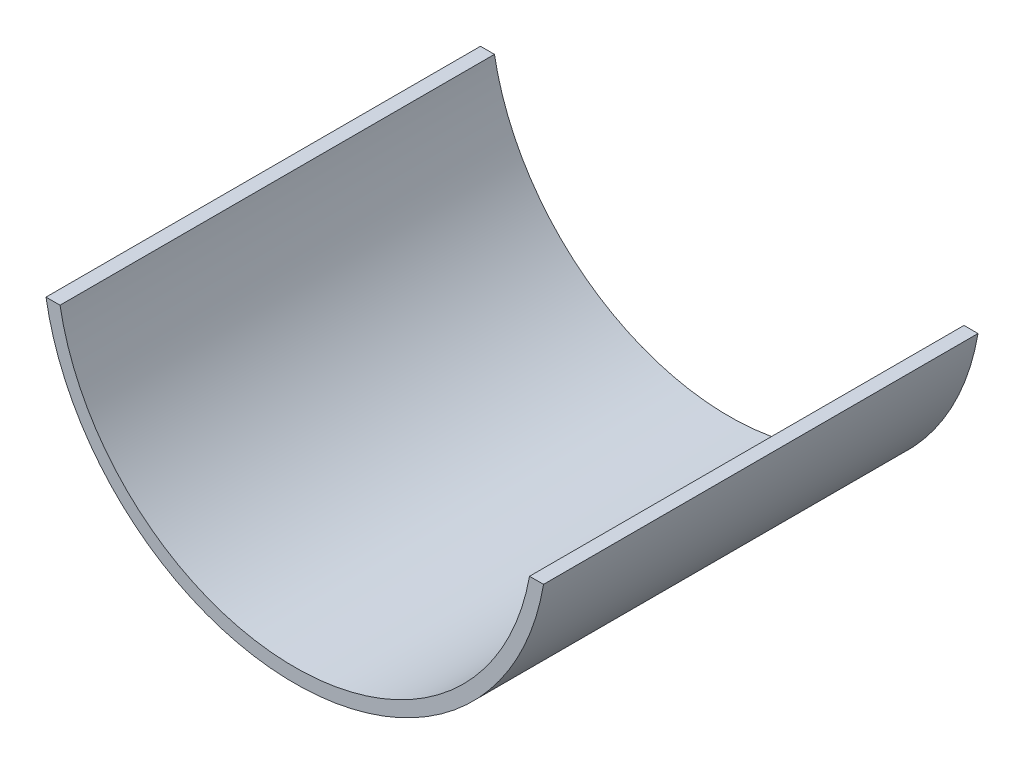
ISO-10303-21;
HEADER;
FILE_DESCRIPTION(('STEP AP214'),'2;1');
FILE_NAME('part.step','',(''),(''),'','','');
FILE_SCHEMA(('AUTOMOTIVE_DESIGN { 1 0 10303 214 1 1 1 1 }'));
ENDSEC;
DATA;
#1=APPLICATION_CONTEXT('core data for automotive mechanical design processes');
#2=APPLICATION_PROTOCOL_DEFINITION('international standard','automotive_design',2000,#1);
#3=PRODUCT_CONTEXT('',#1,'mechanical');
#4=PRODUCT('Part','Part','',(#3));
#5=PRODUCT_RELATED_PRODUCT_CATEGORY('part','',(#4));
#6=PRODUCT_DEFINITION_FORMATION('','',#4);
#7=PRODUCT_DEFINITION_CONTEXT('part definition',#1,'design');
#8=PRODUCT_DEFINITION('design','',#6,#7);
#9=PRODUCT_DEFINITION_SHAPE('','',#8);
#10=(LENGTH_UNIT() NAMED_UNIT(*) SI_UNIT(.MILLI.,.METRE.));
#11=(NAMED_UNIT(*) PLANE_ANGLE_UNIT() SI_UNIT($,.RADIAN.));
#12=(NAMED_UNIT(*) SI_UNIT($,.STERADIAN.) SOLID_ANGLE_UNIT());
#13=UNCERTAINTY_MEASURE_WITH_UNIT(LENGTH_MEASURE(1.E-05),#10,'distance_accuracy_value','');
#14=(GEOMETRIC_REPRESENTATION_CONTEXT(3) GLOBAL_UNCERTAINTY_ASSIGNED_CONTEXT((#13)) GLOBAL_UNIT_ASSIGNED_CONTEXT((#10,
#11,#12)) REPRESENTATION_CONTEXT('',''));
#15=CARTESIAN_POINT('',(0.,0.,0.));
#16=DIRECTION('',(0.,0.,1.));
#17=DIRECTION('',(1.,0.,0.));
#18=AXIS2_PLACEMENT_3D('',#15,#16,#17);
#19=CARTESIAN_POINT('',(0.,0.880200892857,0.));
#20=DIRECTION('',(0.,0.,-1.));
#21=DIRECTION('',(-1.,0.,0.));
#22=AXIS2_PLACEMENT_3D('',#19,#20,#21);
#23=CYLINDRICAL_SURFACE('',#22,0.170200892857);
#24=CARTESIAN_POINT('',(0.,0.880200892857,0.));
#25=DIRECTION('',(0.,0.,-1.));
#26=DIRECTION('',(-1.,0.,0.));
#27=AXIS2_PLACEMENT_3D('',#24,#25,#26);
#28=CIRCLE('',#27,0.170200892857);
#29=CARTESIAN_POINT('',(-0.16749999999994,0.85,0.));
#30=VERTEX_POINT('',#29);
#31=CARTESIAN_POINT('',(0.16749999999994,0.85,0.));
#32=VERTEX_POINT('',#31);
#33=EDGE_CURVE('E59',#30,#32,#28,.F.);
#34=ORIENTED_EDGE('',*,*,#33,.F.);
#35=DIRECTION('',(0.,0.,1.));
#36=VECTOR('',#35,1.);
#37=CARTESIAN_POINT('',(-0.1675,0.85,0.));
#38=LINE('',#37,#36);
#39=CARTESIAN_POINT('',(-0.16749999999994,0.85,0.310000002384));
#40=VERTEX_POINT('',#39);
#41=EDGE_CURVE('E55',#40,#30,#38,.F.);
#42=ORIENTED_EDGE('',*,*,#41,.F.);
#43=CARTESIAN_POINT('',(0.,0.880200892857,0.310000002384));
#44=DIRECTION('',(0.,0.,-1.));
#45=DIRECTION('',(-1.,0.,0.));
#46=AXIS2_PLACEMENT_3D('',#43,#44,#45);
#47=CIRCLE('',#46,0.170200892857);
#48=CARTESIAN_POINT('',(0.16749999999994,0.85,0.310000002384));
#49=VERTEX_POINT('',#48);
#50=EDGE_CURVE('E20',#40,#49,#47,.F.);
#51=ORIENTED_EDGE('',*,*,#50,.T.);
#52=DIRECTION('',(0.,0.,1.));
#53=VECTOR('',#52,1.);
#54=CARTESIAN_POINT('',(0.1675,0.85,0.));
#55=LINE('',#54,#53);
#56=EDGE_CURVE('E82',#32,#49,#55,.T.);
#57=ORIENTED_EDGE('',*,*,#56,.F.);
#58=EDGE_LOOP('',(#34,#42,#51,#57));
#59=FACE_BOUND('',#58,.T.);
#60=ADVANCED_FACE('F17',(#59),#23,.F.);
#61=CARTESIAN_POINT('',(-0.1675,0.85,0.310000002384));
#62=DIRECTION('',(0.,0.,-1.));
#63=DIRECTION('',(-1.,0.,0.));
#64=AXIS2_PLACEMENT_3D('',#61,#62,#63);
#65=PLANE('',#64);
#66=DIRECTION('',(-1.,0.,0.));
#67=VECTOR('',#66,1.);
#68=CARTESIAN_POINT('',(0.1675,0.85,0.310000002384));
#69=LINE('',#68,#67);
#70=CARTESIAN_POINT('',(0.177499999999722,0.850000000000023,0.310000002384));
#71=VERTEX_POINT('',#70);
#72=EDGE_CURVE('E69',#49,#71,#69,.F.);
#73=ORIENTED_EDGE('',*,*,#72,.F.);
#74=ORIENTED_EDGE('',*,*,#50,.F.);
#75=DIRECTION('',(-1.,0.,0.));
#76=VECTOR('',#75,1.);
#77=CARTESIAN_POINT('',(-0.1775,0.85,0.310000002384));
#78=LINE('',#77,#76);
#79=CARTESIAN_POINT('',(-0.177499999999722,0.850000000000023,0.310000002384));
#80=VERTEX_POINT('',#79);
#81=EDGE_CURVE('E63',#80,#40,#78,.F.);
#82=ORIENTED_EDGE('',*,*,#81,.F.);
#83=CARTESIAN_POINT('',(0.,0.880020833333,0.310000002384));
#84=DIRECTION('',(0.,0.,-1.));
#85=DIRECTION('',(-1.,0.,0.));
#86=AXIS2_PLACEMENT_3D('',#83,#84,#85);
#87=CIRCLE('',#86,0.180020833333);
#88=EDGE_CURVE('E81',#71,#80,#87,.T.);
#89=ORIENTED_EDGE('',*,*,#88,.F.);
#90=EDGE_LOOP('',(#73,#74,#82,#89));
#91=FACE_BOUND('',#90,.T.);
#92=ADVANCED_FACE('F66',(#91),#65,.F.);
#93=CARTESIAN_POINT('',(-0.1775,0.85,0.));
#94=DIRECTION('',(0.,1.,0.));
#95=DIRECTION('',(-1.,0.,0.));
#96=AXIS2_PLACEMENT_3D('',#93,#94,#95);
#97=PLANE('',#96);
#98=DIRECTION('',(0.,0.,-1.));
#99=VECTOR('',#98,1.);
#100=CARTESIAN_POINT('',(-0.177499999999726,0.850000000000046,0.));
#101=LINE('',#100,#99);
#102=CARTESIAN_POINT('',(-0.177499999999722,0.850000000000023,0.));
#103=VERTEX_POINT('',#102);
#104=EDGE_CURVE('E73',#80,#103,#101,.T.);
#105=ORIENTED_EDGE('',*,*,#104,.F.);
#106=ORIENTED_EDGE('',*,*,#81,.T.);
#107=ORIENTED_EDGE('',*,*,#41,.T.);
#108=DIRECTION('',(-1.,0.,0.));
#109=VECTOR('',#108,1.);
#110=CARTESIAN_POINT('',(-0.1675,0.85,0.));
#111=LINE('',#110,#109);
#112=EDGE_CURVE('E75',#103,#30,#111,.F.);
#113=ORIENTED_EDGE('',*,*,#112,.F.);
#114=EDGE_LOOP('',(#105,#106,#107,#113));
#115=FACE_BOUND('',#114,.T.);
#116=ADVANCED_FACE('F71',(#115),#97,.T.);
#117=CARTESIAN_POINT('',(-0.1675,0.85,0.));
#118=DIRECTION('',(0.,0.,-1.));
#119=DIRECTION('',(-1.,0.,0.));
#120=AXIS2_PLACEMENT_3D('',#117,#118,#119);
#121=PLANE('',#120);
#122=ORIENTED_EDGE('',*,*,#33,.T.);
#123=DIRECTION('',(-1.,0.,0.));
#124=VECTOR('',#123,1.);
#125=CARTESIAN_POINT('',(0.1675,0.85,0.));
#126=LINE('',#125,#124);
#127=CARTESIAN_POINT('',(0.177499999999722,0.850000000000023,0.));
#128=VERTEX_POINT('',#127);
#129=EDGE_CURVE('E35',#128,#32,#126,.T.);
#130=ORIENTED_EDGE('',*,*,#129,.F.);
#131=CARTESIAN_POINT('',(0.,0.880020833333,0.));
#132=DIRECTION('',(0.,0.,-1.));
#133=DIRECTION('',(-1.,0.,0.));
#134=AXIS2_PLACEMENT_3D('',#131,#132,#133);
#135=CIRCLE('',#134,0.180020833333);
#136=EDGE_CURVE('E26',#103,#128,#135,.F.);
#137=ORIENTED_EDGE('',*,*,#136,.F.);
#138=ORIENTED_EDGE('',*,*,#112,.T.);
#139=EDGE_LOOP('',(#122,#130,#137,#138));
#140=FACE_BOUND('',#139,.T.);
#141=ADVANCED_FACE('F90',(#140),#121,.T.);
#142=CARTESIAN_POINT('',(0.1675,0.85,0.));
#143=DIRECTION('',(0.,1.,0.));
#144=DIRECTION('',(-1.,0.,0.));
#145=AXIS2_PLACEMENT_3D('',#142,#143,#144);
#146=PLANE('',#145);
#147=ORIENTED_EDGE('',*,*,#56,.T.);
#148=ORIENTED_EDGE('',*,*,#72,.T.);
#149=DIRECTION('',(0.,0.,-1.));
#150=VECTOR('',#149,1.);
#151=CARTESIAN_POINT('',(0.177499999999726,0.850000000000046,0.));
#152=LINE('',#151,#150);
#153=EDGE_CURVE('E11',#128,#71,#152,.F.);
#154=ORIENTED_EDGE('',*,*,#153,.F.);
#155=ORIENTED_EDGE('',*,*,#129,.T.);
#156=EDGE_LOOP('',(#147,#148,#154,#155));
#157=FACE_BOUND('',#156,.T.);
#158=ADVANCED_FACE('F87',(#157),#146,.T.);
#159=CARTESIAN_POINT('',(0.,0.880020833333,0.));
#160=DIRECTION('',(0.,0.,-1.));
#161=DIRECTION('',(-1.,0.,0.));
#162=AXIS2_PLACEMENT_3D('',#159,#160,#161);
#163=CYLINDRICAL_SURFACE('',#162,0.180020833333);
#164=ORIENTED_EDGE('',*,*,#136,.T.);
#165=ORIENTED_EDGE('',*,*,#153,.T.);
#166=ORIENTED_EDGE('',*,*,#88,.T.);
#167=ORIENTED_EDGE('',*,*,#104,.T.);
#168=EDGE_LOOP('',(#164,#165,#166,#167));
#169=FACE_BOUND('',#168,.T.);
#170=ADVANCED_FACE('F89',(#169),#163,.T.);
#171=CLOSED_SHELL('',(#60,#92,#116,#141,#158,#170));
#172=MANIFOLD_SOLID_BREP('B1',#171);
#173=ADVANCED_BREP_SHAPE_REPRESENTATION('',(#18,#172),#14);
#174=SHAPE_DEFINITION_REPRESENTATION(#9,#173);
ENDSEC;
END-ISO-10303-21;
